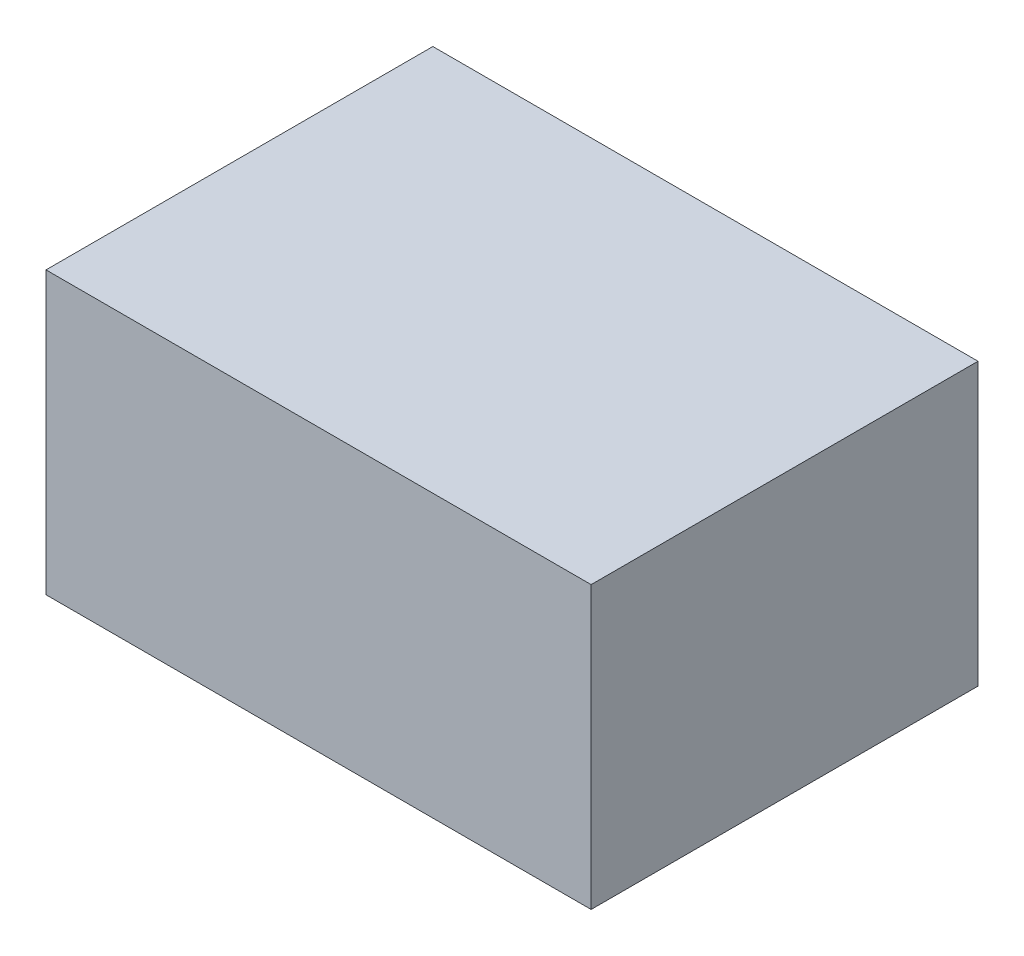
ISO-10303-21;
HEADER;
FILE_DESCRIPTION(('STEP AP214'),'2;1');
FILE_NAME('part.step','',(''),(''),'','','');
FILE_SCHEMA(('AUTOMOTIVE_DESIGN { 1 0 10303 214 1 1 1 1 }'));
ENDSEC;
DATA;
#1=APPLICATION_CONTEXT('core data for automotive mechanical design processes');
#2=APPLICATION_PROTOCOL_DEFINITION('international standard','automotive_design',2000,#1);
#3=PRODUCT_CONTEXT('',#1,'mechanical');
#4=PRODUCT('Part','Part','',(#3));
#5=PRODUCT_RELATED_PRODUCT_CATEGORY('part','',(#4));
#6=PRODUCT_DEFINITION_FORMATION('','',#4);
#7=PRODUCT_DEFINITION_CONTEXT('part definition',#1,'design');
#8=PRODUCT_DEFINITION('design','',#6,#7);
#9=PRODUCT_DEFINITION_SHAPE('','',#8);
#10=(LENGTH_UNIT() NAMED_UNIT(*) SI_UNIT(.MILLI.,.METRE.));
#11=(NAMED_UNIT(*) PLANE_ANGLE_UNIT() SI_UNIT($,.RADIAN.));
#12=(NAMED_UNIT(*) SI_UNIT($,.STERADIAN.) SOLID_ANGLE_UNIT());
#13=UNCERTAINTY_MEASURE_WITH_UNIT(LENGTH_MEASURE(1.E-05),#10,'distance_accuracy_value','');
#14=(GEOMETRIC_REPRESENTATION_CONTEXT(3) GLOBAL_UNCERTAINTY_ASSIGNED_CONTEXT((#13)) GLOBAL_UNIT_ASSIGNED_CONTEXT((#10,
#11,#12)) REPRESENTATION_CONTEXT('',''));
#15=CARTESIAN_POINT('',(0.,0.,0.));
#16=DIRECTION('',(0.,0.,1.));
#17=DIRECTION('',(1.,0.,0.));
#18=AXIS2_PLACEMENT_3D('',#15,#16,#17);
#19=CARTESIAN_POINT('',(0.,32.,0.));
#20=DIRECTION('',(1.,0.,0.));
#21=DIRECTION('',(0.,0.,-1.));
#22=AXIS2_PLACEMENT_3D('',#19,#20,#21);
#23=PLANE('',#22);
#24=DIRECTION('',(0.,0.,1.));
#25=VECTOR('',#24,1.);
#26=CARTESIAN_POINT('',(0.,0.,0.));
#27=LINE('',#26,#25);
#28=CARTESIAN_POINT('',(0.,0.,-44.));
#29=VERTEX_POINT('',#28);
#30=CARTESIAN_POINT('',(0.,0.,0.));
#31=VERTEX_POINT('',#30);
#32=EDGE_CURVE('E100',#29,#31,#27,.T.);
#33=ORIENTED_EDGE('',*,*,#32,.T.);
#34=DIRECTION('',(0.,-1.,0.));
#35=VECTOR('',#34,1.);
#36=CARTESIAN_POINT('',(0.,32.,0.));
#37=LINE('',#36,#35);
#38=CARTESIAN_POINT('',(0.,32.,0.));
#39=VERTEX_POINT('',#38);
#40=EDGE_CURVE('E11',#39,#31,#37,.T.);
#41=ORIENTED_EDGE('',*,*,#40,.F.);
#42=DIRECTION('',(0.,0.,1.));
#43=VECTOR('',#42,1.);
#44=CARTESIAN_POINT('',(0.,32.,0.));
#45=LINE('',#44,#43);
#46=CARTESIAN_POINT('',(0.,32.,-44.));
#47=VERTEX_POINT('',#46);
#48=EDGE_CURVE('E88',#47,#39,#45,.T.);
#49=ORIENTED_EDGE('',*,*,#48,.F.);
#50=DIRECTION('',(0.,-1.,0.));
#51=VECTOR('',#50,1.);
#52=CARTESIAN_POINT('',(0.,32.,-44.));
#53=LINE('',#52,#51);
#54=EDGE_CURVE('E96',#47,#29,#53,.T.);
#55=ORIENTED_EDGE('',*,*,#54,.T.);
#56=EDGE_LOOP('',(#33,#41,#49,#55));
#57=FACE_BOUND('',#56,.T.);
#58=ADVANCED_FACE('F37',(#57),#23,.F.);
#59=CARTESIAN_POINT('',(0.,32.,0.));
#60=DIRECTION('',(0.,0.,-1.));
#61=DIRECTION('',(-1.,0.,0.));
#62=AXIS2_PLACEMENT_3D('',#59,#60,#61);
#63=PLANE('',#62);
#64=DIRECTION('',(1.,0.,0.));
#65=VECTOR('',#64,1.);
#66=CARTESIAN_POINT('',(0.,0.,0.));
#67=LINE('',#66,#65);
#68=CARTESIAN_POINT('',(62.,0.,0.));
#69=VERTEX_POINT('',#68);
#70=EDGE_CURVE('E92',#31,#69,#67,.T.);
#71=ORIENTED_EDGE('',*,*,#70,.T.);
#72=DIRECTION('',(0.,-1.,0.));
#73=VECTOR('',#72,1.);
#74=CARTESIAN_POINT('',(62.,32.,0.));
#75=LINE('',#74,#73);
#76=CARTESIAN_POINT('',(62.,32.,0.));
#77=VERTEX_POINT('',#76);
#78=EDGE_CURVE('E45',#77,#69,#75,.T.);
#79=ORIENTED_EDGE('',*,*,#78,.F.);
#80=DIRECTION('',(1.,0.,0.));
#81=VECTOR('',#80,1.);
#82=CARTESIAN_POINT('',(0.,32.,0.));
#83=LINE('',#82,#81);
#84=EDGE_CURVE('E83',#39,#77,#83,.T.);
#85=ORIENTED_EDGE('',*,*,#84,.F.);
#86=ORIENTED_EDGE('',*,*,#40,.T.);
#87=EDGE_LOOP('',(#71,#79,#85,#86));
#88=FACE_BOUND('',#87,.T.);
#89=ADVANCED_FACE('F91',(#88),#63,.F.);
#90=CARTESIAN_POINT('',(62.,32.,0.));
#91=DIRECTION('',(-1.,0.,0.));
#92=DIRECTION('',(0.,0.,1.));
#93=AXIS2_PLACEMENT_3D('',#90,#91,#92);
#94=PLANE('',#93);
#95=DIRECTION('',(0.,0.,-1.));
#96=VECTOR('',#95,1.);
#97=CARTESIAN_POINT('',(62.,0.,0.));
#98=LINE('',#97,#96);
#99=CARTESIAN_POINT('',(62.,0.,-44.));
#100=VERTEX_POINT('',#99);
#101=EDGE_CURVE('E70',#69,#100,#98,.T.);
#102=ORIENTED_EDGE('',*,*,#101,.T.);
#103=DIRECTION('',(0.,-1.,0.));
#104=VECTOR('',#103,1.);
#105=CARTESIAN_POINT('',(62.,32.,-44.));
#106=LINE('',#105,#104);
#107=CARTESIAN_POINT('',(62.,32.,-44.));
#108=VERTEX_POINT('',#107);
#109=EDGE_CURVE('E93',#108,#100,#106,.T.);
#110=ORIENTED_EDGE('',*,*,#109,.F.);
#111=DIRECTION('',(0.,0.,-1.));
#112=VECTOR('',#111,1.);
#113=CARTESIAN_POINT('',(62.,32.,0.));
#114=LINE('',#113,#112);
#115=EDGE_CURVE('E86',#77,#108,#114,.T.);
#116=ORIENTED_EDGE('',*,*,#115,.F.);
#117=ORIENTED_EDGE('',*,*,#78,.T.);
#118=EDGE_LOOP('',(#102,#110,#116,#117));
#119=FACE_BOUND('',#118,.T.);
#120=ADVANCED_FACE('F94',(#119),#94,.F.);
#121=CARTESIAN_POINT('',(0.,32.,-44.));
#122=DIRECTION('',(0.,0.,1.));
#123=DIRECTION('',(1.,0.,0.));
#124=AXIS2_PLACEMENT_3D('',#121,#122,#123);
#125=PLANE('',#124);
#126=DIRECTION('',(-1.,0.,0.));
#127=VECTOR('',#126,1.);
#128=CARTESIAN_POINT('',(0.,0.,-44.));
#129=LINE('',#128,#127);
#130=EDGE_CURVE('E76',#100,#29,#129,.T.);
#131=ORIENTED_EDGE('',*,*,#130,.T.);
#132=ORIENTED_EDGE('',*,*,#54,.F.);
#133=DIRECTION('',(-1.,0.,0.));
#134=VECTOR('',#133,1.);
#135=CARTESIAN_POINT('',(0.,32.,-44.));
#136=LINE('',#135,#134);
#137=EDGE_CURVE('E53',#108,#47,#136,.T.);
#138=ORIENTED_EDGE('',*,*,#137,.F.);
#139=ORIENTED_EDGE('',*,*,#109,.T.);
#140=EDGE_LOOP('',(#131,#132,#138,#139));
#141=FACE_BOUND('',#140,.T.);
#142=ADVANCED_FACE('F107',(#141),#125,.F.);
#143=CARTESIAN_POINT('',(0.,32.,0.));
#144=DIRECTION('',(0.,-1.,0.));
#145=DIRECTION('',(0.,0.,-1.));
#146=AXIS2_PLACEMENT_3D('',#143,#144,#145);
#147=PLANE('',#146);
#148=ORIENTED_EDGE('',*,*,#48,.T.);
#149=ORIENTED_EDGE('',*,*,#84,.T.);
#150=ORIENTED_EDGE('',*,*,#115,.T.);
#151=ORIENTED_EDGE('',*,*,#137,.T.);
#152=EDGE_LOOP('',(#148,#149,#150,#151));
#153=FACE_BOUND('',#152,.T.);
#154=ADVANCED_FACE('F84',(#153),#147,.F.);
#155=CARTESIAN_POINT('',(0.,0.,0.));
#156=DIRECTION('',(0.,-1.,0.));
#157=DIRECTION('',(0.,0.,-1.));
#158=AXIS2_PLACEMENT_3D('',#155,#156,#157);
#159=PLANE('',#158);
#160=ORIENTED_EDGE('',*,*,#32,.F.);
#161=ORIENTED_EDGE('',*,*,#130,.F.);
#162=ORIENTED_EDGE('',*,*,#101,.F.);
#163=ORIENTED_EDGE('',*,*,#70,.F.);
#164=EDGE_LOOP('',(#160,#161,#162,#163));
#165=FACE_BOUND('',#164,.T.);
#166=ADVANCED_FACE('F110',(#165),#159,.T.);
#167=CLOSED_SHELL('',(#58,#89,#120,#142,#154,#166));
#168=MANIFOLD_SOLID_BREP('B2',#167);
#169=ADVANCED_BREP_SHAPE_REPRESENTATION('',(#18,#168),#14);
#170=SHAPE_DEFINITION_REPRESENTATION(#9,#169);
ENDSEC;
END-ISO-10303-21;
